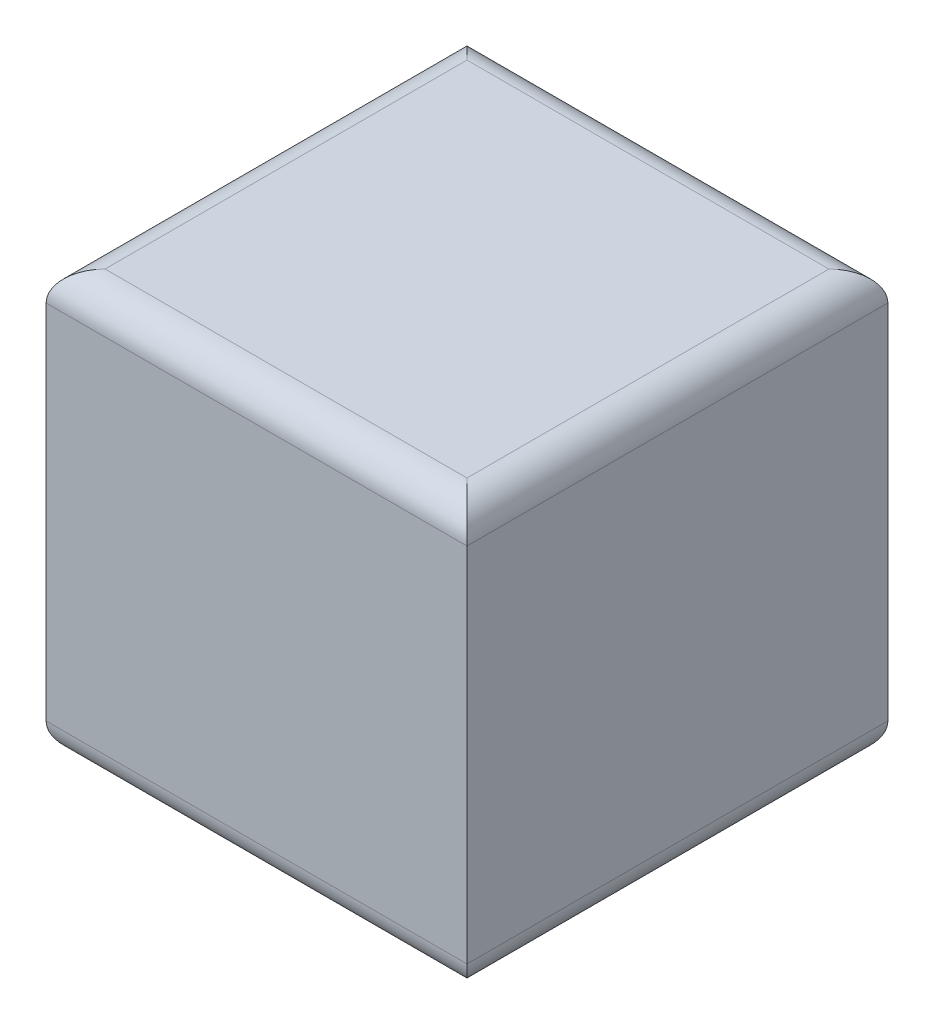
ISO-10303-21;
HEADER;
FILE_DESCRIPTION(('STEP AP214'),'2;1');
FILE_NAME('part.step','',(''),(''),'','','');
FILE_SCHEMA(('AUTOMOTIVE_DESIGN { 1 0 10303 214 1 1 1 1 }'));
ENDSEC;
DATA;
#1=APPLICATION_CONTEXT('core data for automotive mechanical design processes');
#2=APPLICATION_PROTOCOL_DEFINITION('international standard','automotive_design',2000,#1);
#3=PRODUCT_CONTEXT('',#1,'mechanical');
#4=PRODUCT('Part','Part','',(#3));
#5=PRODUCT_RELATED_PRODUCT_CATEGORY('part','',(#4));
#6=PRODUCT_DEFINITION_FORMATION('','',#4);
#7=PRODUCT_DEFINITION_CONTEXT('part definition',#1,'design');
#8=PRODUCT_DEFINITION('design','',#6,#7);
#9=PRODUCT_DEFINITION_SHAPE('','',#8);
#10=(LENGTH_UNIT() NAMED_UNIT(*) SI_UNIT(.MILLI.,.METRE.));
#11=(NAMED_UNIT(*) PLANE_ANGLE_UNIT() SI_UNIT($,.RADIAN.));
#12=(NAMED_UNIT(*) SI_UNIT($,.STERADIAN.) SOLID_ANGLE_UNIT());
#13=UNCERTAINTY_MEASURE_WITH_UNIT(LENGTH_MEASURE(1.E-05),#10,'distance_accuracy_value','');
#14=(GEOMETRIC_REPRESENTATION_CONTEXT(3) GLOBAL_UNCERTAINTY_ASSIGNED_CONTEXT((#13)) GLOBAL_UNIT_ASSIGNED_CONTEXT((#10,
#11,#12)) REPRESENTATION_CONTEXT('',''));
#15=CARTESIAN_POINT('',(0.,0.,0.));
#16=DIRECTION('',(0.,0.,1.));
#17=DIRECTION('',(1.,0.,0.));
#18=AXIS2_PLACEMENT_3D('',#15,#16,#17);
#19=CARTESIAN_POINT('',(0.,1000.,0.));
#20=DIRECTION('',(1.,0.,0.));
#21=DIRECTION('',(0.,0.,-1.));
#22=AXIS2_PLACEMENT_3D('',#19,#20,#21);
#23=PLANE('',#22);
#24=DIRECTION('',(0.,-1.,0.));
#25=VECTOR('',#24,1.);
#26=CARTESIAN_POINT('',(0.,1000.,0.));
#27=LINE('',#26,#25);
#28=CARTESIAN_POINT('',(0.,930.,0.));
#29=VERTEX_POINT('',#28);
#30=CARTESIAN_POINT('',(0.,70.0000000000001,0.));
#31=VERTEX_POINT('',#30);
#32=EDGE_CURVE('E118',#29,#31,#27,.T.);
#33=ORIENTED_EDGE('',*,*,#32,.F.);
#34=DIRECTION('',(0.,0.,1.));
#35=VECTOR('',#34,1.);
#36=CARTESIAN_POINT('',(0.,930.,0.));
#37=LINE('',#36,#35);
#38=CARTESIAN_POINT('',(0.,930.,-1000.));
#39=VERTEX_POINT('',#38);
#40=EDGE_CURVE('E142',#29,#39,#37,.F.);
#41=ORIENTED_EDGE('',*,*,#40,.T.);
#42=DIRECTION('',(0.,-1.,0.));
#43=VECTOR('',#42,1.);
#44=CARTESIAN_POINT('',(0.,1000.,-1000.));
#45=LINE('',#44,#43);
#46=CARTESIAN_POINT('',(0.,70.0000000000001,-1000.));
#47=VERTEX_POINT('',#46);
#48=EDGE_CURVE('E153',#39,#47,#45,.T.);
#49=ORIENTED_EDGE('',*,*,#48,.T.);
#50=DIRECTION('',(0.,0.,1.));
#51=VECTOR('',#50,1.);
#52=CARTESIAN_POINT('',(0.,70.0000000000001,0.));
#53=LINE('',#52,#51);
#54=EDGE_CURVE('E140',#47,#31,#53,.T.);
#55=ORIENTED_EDGE('',*,*,#54,.T.);
#56=EDGE_LOOP('',(#33,#41,#49,#55));
#57=FACE_BOUND('',#56,.T.);
#58=ADVANCED_FACE('F33',(#57),#23,.F.);
#59=CARTESIAN_POINT('',(0.,1000.,0.));
#60=DIRECTION('',(0.,0.,-1.));
#61=DIRECTION('',(-1.,0.,0.));
#62=AXIS2_PLACEMENT_3D('',#59,#60,#61);
#63=PLANE('',#62);
#64=DIRECTION('',(0.,-1.,0.));
#65=VECTOR('',#64,1.);
#66=CARTESIAN_POINT('',(1000.,1000.,0.));
#67=LINE('',#66,#65);
#68=CARTESIAN_POINT('',(1000.,930.,0.));
#69=VERTEX_POINT('',#68);
#70=CARTESIAN_POINT('',(1000.,70.0000000000001,0.));
#71=VERTEX_POINT('',#70);
#72=EDGE_CURVE('E280',#69,#71,#67,.T.);
#73=ORIENTED_EDGE('',*,*,#72,.F.);
#74=DIRECTION('',(1.,0.,0.));
#75=VECTOR('',#74,1.);
#76=CARTESIAN_POINT('',(0.,930.,0.));
#77=LINE('',#76,#75);
#78=EDGE_CURVE('E138',#69,#29,#77,.F.);
#79=ORIENTED_EDGE('',*,*,#78,.T.);
#80=ORIENTED_EDGE('',*,*,#32,.T.);
#81=DIRECTION('',(1.,0.,0.));
#82=VECTOR('',#81,1.);
#83=CARTESIAN_POINT('',(1000.,70.0000000000001,0.));
#84=LINE('',#83,#82);
#85=EDGE_CURVE('E135',#31,#71,#84,.T.);
#86=ORIENTED_EDGE('',*,*,#85,.T.);
#87=EDGE_LOOP('',(#73,#79,#80,#86));
#88=FACE_BOUND('',#87,.T.);
#89=ADVANCED_FACE('F190',(#88),#63,.F.);
#90=CARTESIAN_POINT('',(1000.,1000.,0.));
#91=DIRECTION('',(-1.,0.,0.));
#92=DIRECTION('',(0.,0.,1.));
#93=AXIS2_PLACEMENT_3D('',#90,#91,#92);
#94=PLANE('',#93);
#95=DIRECTION('',(0.,-1.,0.));
#96=VECTOR('',#95,1.);
#97=CARTESIAN_POINT('',(1000.,1000.,-1000.));
#98=LINE('',#97,#96);
#99=CARTESIAN_POINT('',(1000.,930.,-1000.));
#100=VERTEX_POINT('',#99);
#101=CARTESIAN_POINT('',(1000.,70.0000000000001,-1000.));
#102=VERTEX_POINT('',#101);
#103=EDGE_CURVE('E276',#100,#102,#98,.T.);
#104=ORIENTED_EDGE('',*,*,#103,.F.);
#105=DIRECTION('',(0.,0.,-1.));
#106=VECTOR('',#105,1.);
#107=CARTESIAN_POINT('',(1000.,930.,0.));
#108=LINE('',#107,#106);
#109=EDGE_CURVE('E133',#100,#69,#108,.F.);
#110=ORIENTED_EDGE('',*,*,#109,.T.);
#111=ORIENTED_EDGE('',*,*,#72,.T.);
#112=DIRECTION('',(0.,0.,-1.));
#113=VECTOR('',#112,1.);
#114=CARTESIAN_POINT('',(1000.,70.0000000000001,-1000.));
#115=LINE('',#114,#113);
#116=EDGE_CURVE('E131',#71,#102,#115,.T.);
#117=ORIENTED_EDGE('',*,*,#116,.T.);
#118=EDGE_LOOP('',(#104,#110,#111,#117));
#119=FACE_BOUND('',#118,.T.);
#120=ADVANCED_FACE('F196',(#119),#94,.F.);
#121=CARTESIAN_POINT('',(0.,1000.,-1000.));
#122=DIRECTION('',(0.,0.,1.));
#123=DIRECTION('',(1.,0.,0.));
#124=AXIS2_PLACEMENT_3D('',#121,#122,#123);
#125=PLANE('',#124);
#126=ORIENTED_EDGE('',*,*,#48,.F.);
#127=DIRECTION('',(-1.,0.,0.));
#128=VECTOR('',#127,1.);
#129=CARTESIAN_POINT('',(0.,930.,-1000.));
#130=LINE('',#129,#128);
#131=EDGE_CURVE('E105',#39,#100,#130,.F.);
#132=ORIENTED_EDGE('',*,*,#131,.T.);
#133=ORIENTED_EDGE('',*,*,#103,.T.);
#134=DIRECTION('',(-1.,0.,0.));
#135=VECTOR('',#134,1.);
#136=CARTESIAN_POINT('',(0.,70.0000000000001,-1000.));
#137=LINE('',#136,#135);
#138=EDGE_CURVE('E124',#102,#47,#137,.T.);
#139=ORIENTED_EDGE('',*,*,#138,.T.);
#140=EDGE_LOOP('',(#126,#132,#133,#139));
#141=FACE_BOUND('',#140,.T.);
#142=ADVANCED_FACE('F186',(#141),#125,.F.);
#143=CARTESIAN_POINT('',(0.,1000.,0.));
#144=DIRECTION('',(0.,-1.,0.));
#145=DIRECTION('',(0.,0.,-1.));
#146=AXIS2_PLACEMENT_3D('',#143,#144,#145);
#147=PLANE('',#146);
#148=DIRECTION('',(0.,0.,-1.));
#149=VECTOR('',#148,1.);
#150=CARTESIAN_POINT('',(930.,1000.,0.));
#151=LINE('',#150,#149);
#152=CARTESIAN_POINT('',(930.,1000.,-70.));
#153=VERTEX_POINT('',#152);
#154=CARTESIAN_POINT('',(930.,1000.,-930.));
#155=VERTEX_POINT('',#154);
#156=EDGE_CURVE('E122',#153,#155,#151,.T.);
#157=ORIENTED_EDGE('',*,*,#156,.T.);
#158=DIRECTION('',(-1.,0.,0.));
#159=VECTOR('',#158,1.);
#160=CARTESIAN_POINT('',(0.,1000.,-930.));
#161=LINE('',#160,#159);
#162=CARTESIAN_POINT('',(70.,1000.,-930.));
#163=VERTEX_POINT('',#162);
#164=EDGE_CURVE('E103',#155,#163,#161,.T.);
#165=ORIENTED_EDGE('',*,*,#164,.T.);
#166=DIRECTION('',(0.,0.,1.));
#167=VECTOR('',#166,1.);
#168=CARTESIAN_POINT('',(70.,1000.,0.));
#169=LINE('',#168,#167);
#170=CARTESIAN_POINT('',(70.,1000.,-70.));
#171=VERTEX_POINT('',#170);
#172=EDGE_CURVE('E111',#163,#171,#169,.T.);
#173=ORIENTED_EDGE('',*,*,#172,.T.);
#174=DIRECTION('',(1.,0.,0.));
#175=VECTOR('',#174,1.);
#176=CARTESIAN_POINT('',(0.,1000.,-70.));
#177=LINE('',#176,#175);
#178=EDGE_CURVE('E117',#171,#153,#177,.T.);
#179=ORIENTED_EDGE('',*,*,#178,.T.);
#180=EDGE_LOOP('',(#157,#165,#173,#179));
#181=FACE_BOUND('',#180,.T.);
#182=ADVANCED_FACE('F120',(#181),#147,.F.);
#183=CARTESIAN_POINT('',(0.,0.,0.));
#184=DIRECTION('',(0.,-1.,0.));
#185=DIRECTION('',(0.,0.,-1.));
#186=AXIS2_PLACEMENT_3D('',#183,#184,#185);
#187=PLANE('',#186);
#188=DIRECTION('',(0.,0.,-1.));
#189=VECTOR('',#188,1.);
#190=CARTESIAN_POINT('',(930.,0.,0.));
#191=LINE('',#190,#189);
#192=CARTESIAN_POINT('',(930.,0.,-930.));
#193=VERTEX_POINT('',#192);
#194=CARTESIAN_POINT('',(930.,0.,-70.));
#195=VERTEX_POINT('',#194);
#196=EDGE_CURVE('E42',#193,#195,#191,.F.);
#197=ORIENTED_EDGE('',*,*,#196,.T.);
#198=DIRECTION('',(1.,0.,0.));
#199=VECTOR('',#198,1.);
#200=CARTESIAN_POINT('',(0.,0.,-70.));
#201=LINE('',#200,#199);
#202=CARTESIAN_POINT('',(70.,0.,-70.));
#203=VERTEX_POINT('',#202);
#204=EDGE_CURVE('E11',#195,#203,#201,.F.);
#205=ORIENTED_EDGE('',*,*,#204,.T.);
#206=DIRECTION('',(0.,0.,1.));
#207=VECTOR('',#206,1.);
#208=CARTESIAN_POINT('',(70.,0.,-1000.));
#209=LINE('',#208,#207);
#210=CARTESIAN_POINT('',(70.,0.,-930.));
#211=VERTEX_POINT('',#210);
#212=EDGE_CURVE('E144',#203,#211,#209,.F.);
#213=ORIENTED_EDGE('',*,*,#212,.T.);
#214=DIRECTION('',(-1.,0.,0.));
#215=VECTOR('',#214,1.);
#216=CARTESIAN_POINT('',(1000.,0.,-930.));
#217=LINE('',#216,#215);
#218=EDGE_CURVE('E53',#211,#193,#217,.F.);
#219=ORIENTED_EDGE('',*,*,#218,.T.);
#220=EDGE_LOOP('',(#197,#205,#213,#219));
#221=FACE_BOUND('',#220,.T.);
#222=ADVANCED_FACE('F175',(#221),#187,.T.);
#223=CARTESIAN_POINT('',(0.,930.,-70.));
#224=DIRECTION('',(1.,0.,0.));
#225=DIRECTION('',(0.,0.,-1.));
#226=AXIS2_PLACEMENT_3D('',#223,#224,#225);
#227=CYLINDRICAL_SURFACE('',#226,70.);
#228=CARTESIAN_POINT('',(70.,930.,-70.));
#229=DIRECTION('',(0.707106781186547,0.,0.707106781186547));
#230=DIRECTION('',(-0.707106781186547,0.,0.707106781186547));
#231=AXIS2_PLACEMENT_3D('',#228,#229,#230);
#232=ELLIPSE('',#231,98.9949493661166,70.);
#233=EDGE_CURVE('E114',#29,#171,#232,.F.);
#234=ORIENTED_EDGE('',*,*,#233,.F.);
#235=ORIENTED_EDGE('',*,*,#78,.F.);
#236=CARTESIAN_POINT('',(930.,930.,-70.));
#237=DIRECTION('',(0.707106781186547,0.,-0.707106781186547));
#238=DIRECTION('',(0.707106781186547,0.,0.707106781186547));
#239=AXIS2_PLACEMENT_3D('',#236,#237,#238);
#240=ELLIPSE('',#239,98.9949493661166,70.);
#241=EDGE_CURVE('E150',#153,#69,#240,.T.);
#242=ORIENTED_EDGE('',*,*,#241,.F.);
#243=ORIENTED_EDGE('',*,*,#178,.F.);
#244=EDGE_LOOP('',(#234,#235,#242,#243));
#245=FACE_BOUND('',#244,.T.);
#246=ADVANCED_FACE('F177',(#245),#227,.T.);
#247=CARTESIAN_POINT('',(930.,930.,0.));
#248=DIRECTION('',(0.,0.,-1.));
#249=DIRECTION('',(-1.,0.,0.));
#250=AXIS2_PLACEMENT_3D('',#247,#248,#249);
#251=CYLINDRICAL_SURFACE('',#250,70.);
#252=ORIENTED_EDGE('',*,*,#241,.T.);
#253=ORIENTED_EDGE('',*,*,#109,.F.);
#254=CARTESIAN_POINT('',(930.,930.,-930.));
#255=DIRECTION('',(-0.707106781186547,0.,-0.707106781186547));
#256=DIRECTION('',(0.707106781186547,0.,-0.707106781186547));
#257=AXIS2_PLACEMENT_3D('',#254,#255,#256);
#258=ELLIPSE('',#257,98.9949493661166,70.);
#259=EDGE_CURVE('E108',#155,#100,#258,.T.);
#260=ORIENTED_EDGE('',*,*,#259,.F.);
#261=ORIENTED_EDGE('',*,*,#156,.F.);
#262=EDGE_LOOP('',(#252,#253,#260,#261));
#263=FACE_BOUND('',#262,.T.);
#264=ADVANCED_FACE('F183',(#263),#251,.T.);
#265=CARTESIAN_POINT('',(70.,930.,0.));
#266=DIRECTION('',(0.,0.,1.));
#267=DIRECTION('',(1.,0.,0.));
#268=AXIS2_PLACEMENT_3D('',#265,#266,#267);
#269=CYLINDRICAL_SURFACE('',#268,70.);
#270=ORIENTED_EDGE('',*,*,#233,.T.);
#271=ORIENTED_EDGE('',*,*,#172,.F.);
#272=CARTESIAN_POINT('',(70.,930.,-930.));
#273=DIRECTION('',(-0.707106781186547,0.,0.707106781186547));
#274=DIRECTION('',(0.707106781186547,0.,0.707106781186547));
#275=AXIS2_PLACEMENT_3D('',#272,#273,#274);
#276=ELLIPSE('',#275,98.9949493661166,70.);
#277=EDGE_CURVE('E99',#39,#163,#276,.F.);
#278=ORIENTED_EDGE('',*,*,#277,.F.);
#279=ORIENTED_EDGE('',*,*,#40,.F.);
#280=EDGE_LOOP('',(#270,#271,#278,#279));
#281=FACE_BOUND('',#280,.T.);
#282=ADVANCED_FACE('F112',(#281),#269,.T.);
#283=CARTESIAN_POINT('',(0.,930.,-930.));
#284=DIRECTION('',(-1.,0.,0.));
#285=DIRECTION('',(0.,0.,1.));
#286=AXIS2_PLACEMENT_3D('',#283,#284,#285);
#287=CYLINDRICAL_SURFACE('',#286,70.);
#288=ORIENTED_EDGE('',*,*,#259,.T.);
#289=ORIENTED_EDGE('',*,*,#131,.F.);
#290=ORIENTED_EDGE('',*,*,#277,.T.);
#291=ORIENTED_EDGE('',*,*,#164,.F.);
#292=EDGE_LOOP('',(#288,#289,#290,#291));
#293=FACE_BOUND('',#292,.T.);
#294=ADVANCED_FACE('F101',(#293),#287,.T.);
#295=CARTESIAN_POINT('',(0.,70.0000000000001,-930.));
#296=DIRECTION('',(1.,0.,0.));
#297=DIRECTION('',(0.,0.,-1.));
#298=AXIS2_PLACEMENT_3D('',#295,#296,#297);
#299=CYLINDRICAL_SURFACE('',#298,70.);
#300=CARTESIAN_POINT('',(930.,70.0000000000001,-930.));
#301=DIRECTION('',(0.707106781186547,0.,0.707106781186547));
#302=DIRECTION('',(0.707106781186547,0.,-0.707106781186547));
#303=AXIS2_PLACEMENT_3D('',#300,#301,#302);
#304=ELLIPSE('',#303,98.9949493661166,70.);
#305=EDGE_CURVE('E157',#193,#102,#304,.T.);
#306=ORIENTED_EDGE('',*,*,#305,.F.);
#307=ORIENTED_EDGE('',*,*,#218,.F.);
#308=CARTESIAN_POINT('',(70.,70.0000000000001,-930.));
#309=DIRECTION('',(0.707106781186547,0.,-0.707106781186547));
#310=DIRECTION('',(-0.707106781186547,0.,-0.707106781186547));
#311=AXIS2_PLACEMENT_3D('',#308,#309,#310);
#312=ELLIPSE('',#311,98.9949493661166,70.);
#313=EDGE_CURVE('E37',#47,#211,#312,.F.);
#314=ORIENTED_EDGE('',*,*,#313,.F.);
#315=ORIENTED_EDGE('',*,*,#138,.F.);
#316=EDGE_LOOP('',(#306,#307,#314,#315));
#317=FACE_BOUND('',#316,.T.);
#318=ADVANCED_FACE('F35',(#317),#299,.T.);
#319=CARTESIAN_POINT('',(70.,70.0000000000001,0.));
#320=DIRECTION('',(0.,0.,-1.));
#321=DIRECTION('',(-1.,0.,0.));
#322=AXIS2_PLACEMENT_3D('',#319,#320,#321);
#323=CYLINDRICAL_SURFACE('',#322,70.);
#324=ORIENTED_EDGE('',*,*,#313,.T.);
#325=ORIENTED_EDGE('',*,*,#212,.F.);
#326=CARTESIAN_POINT('',(70.,70.0000000000001,-70.));
#327=DIRECTION('',(-0.707106781186547,0.,-0.707106781186547));
#328=DIRECTION('',(0.707106781186547,0.,-0.707106781186547));
#329=AXIS2_PLACEMENT_3D('',#326,#327,#328);
#330=ELLIPSE('',#329,98.9949493661166,70.);
#331=EDGE_CURVE('E156',#31,#203,#330,.F.);
#332=ORIENTED_EDGE('',*,*,#331,.F.);
#333=ORIENTED_EDGE('',*,*,#54,.F.);
#334=EDGE_LOOP('',(#324,#325,#332,#333));
#335=FACE_BOUND('',#334,.T.);
#336=ADVANCED_FACE('F166',(#335),#323,.T.);
#337=CARTESIAN_POINT('',(930.,70.0000000000001,0.));
#338=DIRECTION('',(0.,0.,1.));
#339=DIRECTION('',(1.,0.,0.));
#340=AXIS2_PLACEMENT_3D('',#337,#338,#339);
#341=CYLINDRICAL_SURFACE('',#340,70.);
#342=ORIENTED_EDGE('',*,*,#305,.T.);
#343=ORIENTED_EDGE('',*,*,#116,.F.);
#344=CARTESIAN_POINT('',(930.,70.0000000000001,-70.));
#345=DIRECTION('',(-0.707106781186547,0.,0.707106781186547));
#346=DIRECTION('',(0.707106781186547,0.,0.707106781186547));
#347=AXIS2_PLACEMENT_3D('',#344,#345,#346);
#348=ELLIPSE('',#347,98.9949493661166,70.);
#349=EDGE_CURVE('E154',#195,#71,#348,.T.);
#350=ORIENTED_EDGE('',*,*,#349,.F.);
#351=ORIENTED_EDGE('',*,*,#196,.F.);
#352=EDGE_LOOP('',(#342,#343,#350,#351));
#353=FACE_BOUND('',#352,.T.);
#354=ADVANCED_FACE('F171',(#353),#341,.T.);
#355=CARTESIAN_POINT('',(0.,70.0000000000001,-70.));
#356=DIRECTION('',(-1.,0.,0.));
#357=DIRECTION('',(0.,0.,1.));
#358=AXIS2_PLACEMENT_3D('',#355,#356,#357);
#359=CYLINDRICAL_SURFACE('',#358,70.);
#360=ORIENTED_EDGE('',*,*,#331,.T.);
#361=ORIENTED_EDGE('',*,*,#204,.F.);
#362=ORIENTED_EDGE('',*,*,#349,.T.);
#363=ORIENTED_EDGE('',*,*,#85,.F.);
#364=EDGE_LOOP('',(#360,#361,#362,#363));
#365=FACE_BOUND('',#364,.T.);
#366=ADVANCED_FACE('F174',(#365),#359,.T.);
#367=CLOSED_SHELL('',(#58,#89,#120,#142,#182,#222,#246,#264,#282,#294,#318,#336,#354,#366));
#368=MANIFOLD_SOLID_BREP('B2',#367);
#369=ADVANCED_BREP_SHAPE_REPRESENTATION('',(#18,#368),#14);
#370=SHAPE_DEFINITION_REPRESENTATION(#9,#369);
ENDSEC;
END-ISO-10303-21;
